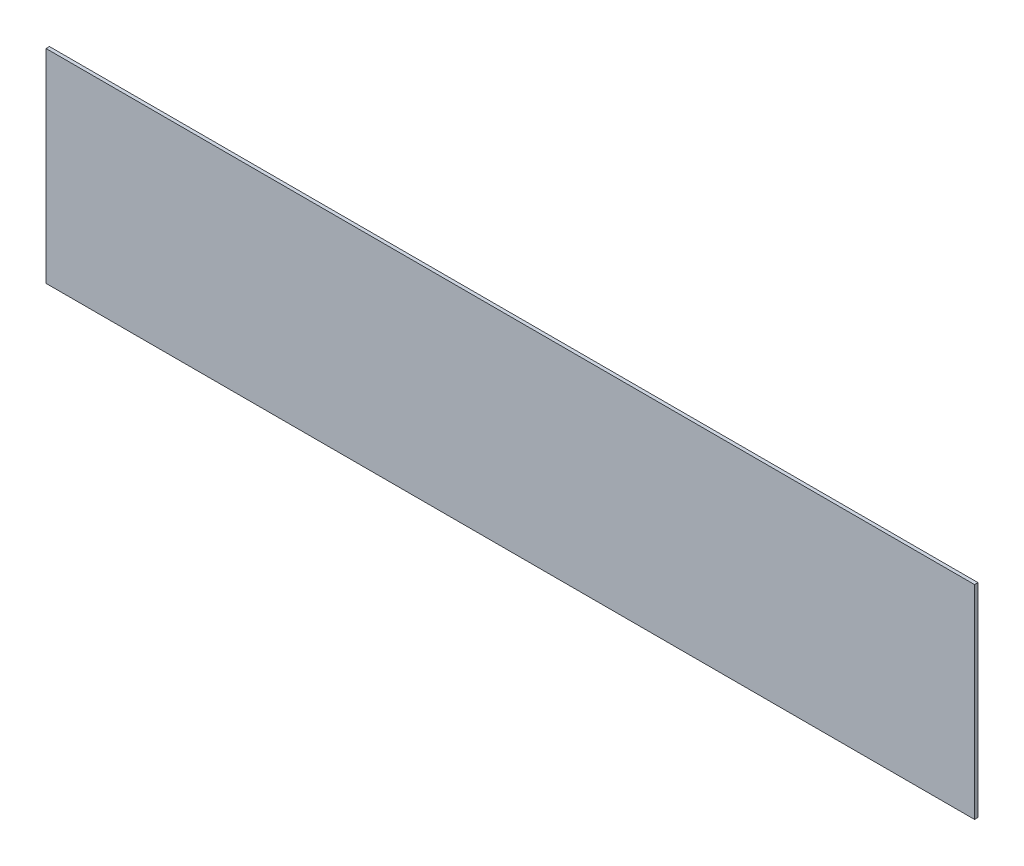
ISO-10303-21;
HEADER;
FILE_DESCRIPTION(('STEP AP214'),'2;1');
FILE_NAME('part.step','',(''),(''),'','','');
FILE_SCHEMA(('AUTOMOTIVE_DESIGN { 1 0 10303 214 1 1 1 1 }'));
ENDSEC;
DATA;
#1=APPLICATION_CONTEXT('core data for automotive mechanical design processes');
#2=APPLICATION_PROTOCOL_DEFINITION('international standard','automotive_design',2000,#1);
#3=PRODUCT_CONTEXT('',#1,'mechanical');
#4=PRODUCT('Part','Part','',(#3));
#5=PRODUCT_RELATED_PRODUCT_CATEGORY('part','',(#4));
#6=PRODUCT_DEFINITION_FORMATION('','',#4);
#7=PRODUCT_DEFINITION_CONTEXT('part definition',#1,'design');
#8=PRODUCT_DEFINITION('design','',#6,#7);
#9=PRODUCT_DEFINITION_SHAPE('','',#8);
#10=(LENGTH_UNIT() NAMED_UNIT(*) SI_UNIT(.MILLI.,.METRE.));
#11=(NAMED_UNIT(*) PLANE_ANGLE_UNIT() SI_UNIT($,.RADIAN.));
#12=(NAMED_UNIT(*) SI_UNIT($,.STERADIAN.) SOLID_ANGLE_UNIT());
#13=UNCERTAINTY_MEASURE_WITH_UNIT(LENGTH_MEASURE(1.E-05),#10,'distance_accuracy_value','');
#14=(GEOMETRIC_REPRESENTATION_CONTEXT(3) GLOBAL_UNCERTAINTY_ASSIGNED_CONTEXT((#13)) GLOBAL_UNIT_ASSIGNED_CONTEXT((#10,
#11,#12)) REPRESENTATION_CONTEXT('',''));
#15=CARTESIAN_POINT('',(0.,0.,0.));
#16=DIRECTION('',(0.,0.,1.));
#17=DIRECTION('',(1.,0.,0.));
#18=AXIS2_PLACEMENT_3D('',#15,#16,#17);
#19=CARTESIAN_POINT('',(271.6,851.,576.88772659299));
#20=DIRECTION('',(0.,-1.,0.));
#21=DIRECTION('',(1.,0.,0.));
#22=AXIS2_PLACEMENT_3D('',#19,#20,#21);
#23=PLANE('',#22);
#24=DIRECTION('',(1.,0.,0.));
#25=VECTOR('',#24,1.);
#26=CARTESIAN_POINT('',(271.6,851.,578.88772659299));
#27=LINE('',#26,#25);
#28=CARTESIAN_POINT('',(-271.6,851.,578.88772659299));
#29=VERTEX_POINT('',#28);
#30=CARTESIAN_POINT('',(271.6,851.,578.88772659299));
#31=VERTEX_POINT('',#30);
#32=EDGE_CURVE('E100',#29,#31,#27,.T.);
#33=ORIENTED_EDGE('',*,*,#32,.F.);
#34=DIRECTION('',(0.,0.,1.));
#35=VECTOR('',#34,1.);
#36=CARTESIAN_POINT('',(-271.6,851.,576.88772659299));
#37=LINE('',#36,#35);
#38=CARTESIAN_POINT('',(-271.6,851.,576.88772659299));
#39=VERTEX_POINT('',#38);
#40=EDGE_CURVE('E11',#39,#29,#37,.T.);
#41=ORIENTED_EDGE('',*,*,#40,.F.);
#42=DIRECTION('',(1.,0.,0.));
#43=VECTOR('',#42,1.);
#44=CARTESIAN_POINT('',(271.6,851.,576.88772659299));
#45=LINE('',#44,#43);
#46=CARTESIAN_POINT('',(271.6,851.,576.88772659299));
#47=VERTEX_POINT('',#46);
#48=EDGE_CURVE('E94',#39,#47,#45,.T.);
#49=ORIENTED_EDGE('',*,*,#48,.T.);
#50=DIRECTION('',(0.,0.,1.));
#51=VECTOR('',#50,1.);
#52=CARTESIAN_POINT('',(271.6,851.,576.88772659299));
#53=LINE('',#52,#51);
#54=EDGE_CURVE('E39',#47,#31,#53,.T.);
#55=ORIENTED_EDGE('',*,*,#54,.T.);
#56=EDGE_LOOP('',(#33,#41,#49,#55));
#57=FACE_BOUND('',#56,.T.);
#58=ADVANCED_FACE('F36',(#57),#23,.T.);
#59=CARTESIAN_POINT('',(-271.6,970.,576.88772659299));
#60=DIRECTION('',(-1.,0.,0.));
#61=DIRECTION('',(0.,0.,1.));
#62=AXIS2_PLACEMENT_3D('',#59,#60,#61);
#63=PLANE('',#62);
#64=DIRECTION('',(0.,-1.,0.));
#65=VECTOR('',#64,1.);
#66=CARTESIAN_POINT('',(-271.6,970.,578.88772659299));
#67=LINE('',#66,#65);
#68=CARTESIAN_POINT('',(-271.6,970.,578.88772659299));
#69=VERTEX_POINT('',#68);
#70=EDGE_CURVE('E96',#69,#29,#67,.T.);
#71=ORIENTED_EDGE('',*,*,#70,.F.);
#72=DIRECTION('',(0.,0.,1.));
#73=VECTOR('',#72,1.);
#74=CARTESIAN_POINT('',(-271.6,970.,576.88772659299));
#75=LINE('',#74,#73);
#76=CARTESIAN_POINT('',(-271.6,970.,576.88772659299));
#77=VERTEX_POINT('',#76);
#78=EDGE_CURVE('E45',#77,#69,#75,.T.);
#79=ORIENTED_EDGE('',*,*,#78,.F.);
#80=DIRECTION('',(0.,-1.,0.));
#81=VECTOR('',#80,1.);
#82=CARTESIAN_POINT('',(-271.6,970.,576.88772659299));
#83=LINE('',#82,#81);
#84=EDGE_CURVE('E91',#77,#39,#83,.T.);
#85=ORIENTED_EDGE('',*,*,#84,.T.);
#86=ORIENTED_EDGE('',*,*,#40,.T.);
#87=EDGE_LOOP('',(#71,#79,#85,#86));
#88=FACE_BOUND('',#87,.T.);
#89=ADVANCED_FACE('F110',(#88),#63,.T.);
#90=CARTESIAN_POINT('',(-271.6,970.,576.88772659299));
#91=DIRECTION('',(0.,1.,0.));
#92=DIRECTION('',(-1.,0.,0.));
#93=AXIS2_PLACEMENT_3D('',#90,#91,#92);
#94=PLANE('',#93);
#95=DIRECTION('',(-1.,0.,0.));
#96=VECTOR('',#95,1.);
#97=CARTESIAN_POINT('',(-271.6,970.,578.88772659299));
#98=LINE('',#97,#96);
#99=CARTESIAN_POINT('',(271.6,970.,578.88772659299));
#100=VERTEX_POINT('',#99);
#101=EDGE_CURVE('E86',#100,#69,#98,.T.);
#102=ORIENTED_EDGE('',*,*,#101,.F.);
#103=DIRECTION('',(0.,0.,1.));
#104=VECTOR('',#103,1.);
#105=CARTESIAN_POINT('',(271.6,970.,576.88772659299));
#106=LINE('',#105,#104);
#107=CARTESIAN_POINT('',(271.6,970.,576.88772659299));
#108=VERTEX_POINT('',#107);
#109=EDGE_CURVE('E81',#108,#100,#106,.T.);
#110=ORIENTED_EDGE('',*,*,#109,.F.);
#111=DIRECTION('',(-1.,0.,0.));
#112=VECTOR('',#111,1.);
#113=CARTESIAN_POINT('',(-271.6,970.,576.88772659299));
#114=LINE('',#113,#112);
#115=EDGE_CURVE('E84',#108,#77,#114,.T.);
#116=ORIENTED_EDGE('',*,*,#115,.T.);
#117=ORIENTED_EDGE('',*,*,#78,.T.);
#118=EDGE_LOOP('',(#102,#110,#116,#117));
#119=FACE_BOUND('',#118,.T.);
#120=ADVANCED_FACE('F83',(#119),#94,.T.);
#121=CARTESIAN_POINT('',(271.6,851.,576.88772659299));
#122=DIRECTION('',(1.,0.,0.));
#123=DIRECTION('',(0.,0.,-1.));
#124=AXIS2_PLACEMENT_3D('',#121,#122,#123);
#125=PLANE('',#124);
#126=DIRECTION('',(0.,1.,0.));
#127=VECTOR('',#126,1.);
#128=CARTESIAN_POINT('',(271.6,851.,578.88772659299));
#129=LINE('',#128,#127);
#130=EDGE_CURVE('E103',#31,#100,#129,.T.);
#131=ORIENTED_EDGE('',*,*,#130,.F.);
#132=ORIENTED_EDGE('',*,*,#54,.F.);
#133=DIRECTION('',(0.,1.,0.));
#134=VECTOR('',#133,1.);
#135=CARTESIAN_POINT('',(271.6,851.,576.88772659299));
#136=LINE('',#135,#134);
#137=EDGE_CURVE('E90',#47,#108,#136,.T.);
#138=ORIENTED_EDGE('',*,*,#137,.T.);
#139=ORIENTED_EDGE('',*,*,#109,.T.);
#140=EDGE_LOOP('',(#131,#132,#138,#139));
#141=FACE_BOUND('',#140,.T.);
#142=ADVANCED_FACE('F93',(#141),#125,.T.);
#143=CARTESIAN_POINT('',(0.,0.,576.88772659299));
#144=DIRECTION('',(0.,0.,1.));
#145=DIRECTION('',(1.,0.,0.));
#146=AXIS2_PLACEMENT_3D('',#143,#144,#145);
#147=PLANE('',#146);
#148=ORIENTED_EDGE('',*,*,#48,.F.);
#149=ORIENTED_EDGE('',*,*,#84,.F.);
#150=ORIENTED_EDGE('',*,*,#115,.F.);
#151=ORIENTED_EDGE('',*,*,#137,.F.);
#152=EDGE_LOOP('',(#148,#149,#150,#151));
#153=FACE_BOUND('',#152,.T.);
#154=ADVANCED_FACE('F89',(#153),#147,.F.);
#155=CARTESIAN_POINT('',(0.,0.,578.88772659299));
#156=DIRECTION('',(0.,0.,1.));
#157=DIRECTION('',(1.,0.,0.));
#158=AXIS2_PLACEMENT_3D('',#155,#156,#157);
#159=PLANE('',#158);
#160=ORIENTED_EDGE('',*,*,#32,.T.);
#161=ORIENTED_EDGE('',*,*,#130,.T.);
#162=ORIENTED_EDGE('',*,*,#101,.T.);
#163=ORIENTED_EDGE('',*,*,#70,.T.);
#164=EDGE_LOOP('',(#160,#161,#162,#163));
#165=FACE_BOUND('',#164,.T.);
#166=ADVANCED_FACE('F109',(#165),#159,.T.);
#167=CLOSED_SHELL('',(#58,#89,#120,#142,#154,#166));
#168=MANIFOLD_SOLID_BREP('B2',#167);
#169=ADVANCED_BREP_SHAPE_REPRESENTATION('',(#18,#168),#14);
#170=SHAPE_DEFINITION_REPRESENTATION(#9,#169);
ENDSEC;
END-ISO-10303-21;
